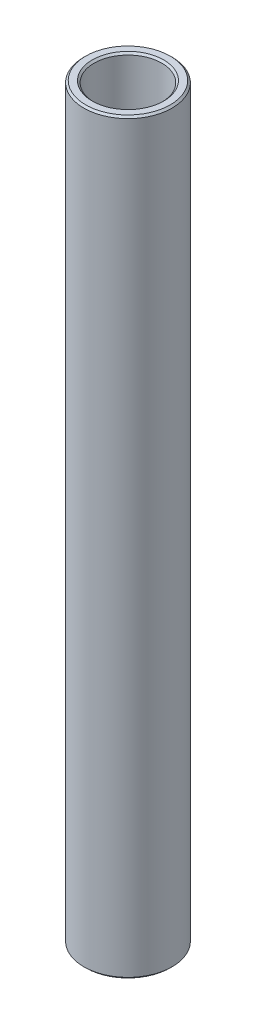
ISO-10303-21;
HEADER;
FILE_DESCRIPTION(('STEP AP214'),'2;1');
FILE_NAME('part.step','',(''),(''),'','','');
FILE_SCHEMA(('AUTOMOTIVE_DESIGN { 1 0 10303 214 1 1 1 1 }'));
ENDSEC;
DATA;
#1=APPLICATION_CONTEXT('core data for automotive mechanical design processes');
#2=APPLICATION_PROTOCOL_DEFINITION('international standard','automotive_design',2000,#1);
#3=PRODUCT_CONTEXT('',#1,'mechanical');
#4=PRODUCT('Part','Part','',(#3));
#5=PRODUCT_RELATED_PRODUCT_CATEGORY('part','',(#4));
#6=PRODUCT_DEFINITION_FORMATION('','',#4);
#7=PRODUCT_DEFINITION_CONTEXT('part definition',#1,'design');
#8=PRODUCT_DEFINITION('design','',#6,#7);
#9=PRODUCT_DEFINITION_SHAPE('','',#8);
#10=(LENGTH_UNIT() NAMED_UNIT(*) SI_UNIT(.MILLI.,.METRE.));
#11=(NAMED_UNIT(*) PLANE_ANGLE_UNIT() SI_UNIT($,.RADIAN.));
#12=(NAMED_UNIT(*) SI_UNIT($,.STERADIAN.) SOLID_ANGLE_UNIT());
#13=UNCERTAINTY_MEASURE_WITH_UNIT(LENGTH_MEASURE(1.E-05),#10,'distance_accuracy_value','');
#14=(GEOMETRIC_REPRESENTATION_CONTEXT(3) GLOBAL_UNCERTAINTY_ASSIGNED_CONTEXT((#13)) GLOBAL_UNIT_ASSIGNED_CONTEXT((#10,
#11,#12)) REPRESENTATION_CONTEXT('',''));
#15=CARTESIAN_POINT('',(0.,0.,0.));
#16=DIRECTION('',(0.,0.,1.));
#17=DIRECTION('',(1.,0.,0.));
#18=AXIS2_PLACEMENT_3D('',#15,#16,#17);
#19=CARTESIAN_POINT('',(3.00000000000001,25.4,0.));
#20=DIRECTION('',(0.,-1.,0.));
#21=DIRECTION('',(0.,0.,-1.));
#22=AXIS2_PLACEMENT_3D('',#19,#20,#21);
#23=PLANE('',#22);
#24=CARTESIAN_POINT('',(0.,25.4,0.));
#25=DIRECTION('',(0.,-1.,0.));
#26=DIRECTION('',(0.,0.,-1.));
#27=AXIS2_PLACEMENT_3D('',#24,#25,#26);
#28=CIRCLE('',#27,2.87300000000001);
#29=CARTESIAN_POINT('',(0.,25.4,-2.87300000000001));
#30=VERTEX_POINT('',#29);
#31=EDGE_CURVE('E10',#30,#30,#28,.F.);
#32=ORIENTED_EDGE('',*,*,#31,.T.);
#33=EDGE_LOOP('',(#32));
#34=FACE_BOUND('',#33,.T.);
#35=CARTESIAN_POINT('',(0.,25.4,0.));
#36=DIRECTION('',(0.,-1.,0.));
#37=DIRECTION('',(0.,0.,-1.));
#38=AXIS2_PLACEMENT_3D('',#35,#36,#37);
#39=CIRCLE('',#38,2.427);
#40=CARTESIAN_POINT('',(0.,25.4,-2.427));
#41=VERTEX_POINT('',#40);
#42=EDGE_CURVE('E37',#41,#41,#39,.T.);
#43=ORIENTED_EDGE('',*,*,#42,.T.);
#44=EDGE_LOOP('',(#43));
#45=FACE_BOUND('',#44,.T.);
#46=ADVANCED_FACE('F30',(#34,#45),#23,.F.);
#47=CARTESIAN_POINT('',(0.,19.0679886685552,0.));
#48=DIRECTION('',(0.,1.,0.));
#49=DIRECTION('',(0.,0.,1.));
#50=AXIS2_PLACEMENT_3D('',#47,#48,#49);
#51=CYLINDRICAL_SURFACE('',#50,2.3);
#52=CARTESIAN_POINT('',(0.,-25.273,0.));
#53=DIRECTION('',(0.,1.,0.));
#54=DIRECTION('',(0.,0.,1.));
#55=AXIS2_PLACEMENT_3D('',#52,#53,#54);
#56=CIRCLE('',#55,2.3);
#57=CARTESIAN_POINT('',(0.,-25.273,2.3));
#58=VERTEX_POINT('',#57);
#59=EDGE_CURVE('E50',#58,#58,#56,.F.);
#60=ORIENTED_EDGE('',*,*,#59,.T.);
#61=EDGE_LOOP('',(#60));
#62=FACE_BOUND('',#61,.T.);
#63=CARTESIAN_POINT('',(0.,25.273,0.));
#64=DIRECTION('',(0.,-1.,0.));
#65=DIRECTION('',(0.,0.,-1.));
#66=AXIS2_PLACEMENT_3D('',#63,#64,#65);
#67=CIRCLE('',#66,2.3);
#68=CARTESIAN_POINT('',(0.,25.273,-2.3));
#69=VERTEX_POINT('',#68);
#70=EDGE_CURVE('E53',#69,#69,#67,.F.);
#71=ORIENTED_EDGE('',*,*,#70,.T.);
#72=EDGE_LOOP('',(#71));
#73=FACE_BOUND('',#72,.T.);
#74=ADVANCED_FACE('F86',(#62,#73),#51,.F.);
#75=CARTESIAN_POINT('',(2.30000000000001,-25.4,0.));
#76=DIRECTION('',(0.,1.,0.));
#77=DIRECTION('',(0.,0.,1.));
#78=AXIS2_PLACEMENT_3D('',#75,#76,#77);
#79=PLANE('',#78);
#80=CARTESIAN_POINT('',(0.,-25.4,0.));
#81=DIRECTION('',(0.,1.,0.));
#82=DIRECTION('',(0.,0.,1.));
#83=AXIS2_PLACEMENT_3D('',#80,#81,#82);
#84=CIRCLE('',#83,2.42700000000001);
#85=CARTESIAN_POINT('',(0.,-25.4,2.42700000000001));
#86=VERTEX_POINT('',#85);
#87=EDGE_CURVE('E56',#86,#86,#84,.T.);
#88=ORIENTED_EDGE('',*,*,#87,.T.);
#89=EDGE_LOOP('',(#88));
#90=FACE_BOUND('',#89,.T.);
#91=CARTESIAN_POINT('',(0.,-25.4,0.));
#92=DIRECTION('',(0.,1.,0.));
#93=DIRECTION('',(0.,0.,1.));
#94=AXIS2_PLACEMENT_3D('',#91,#92,#93);
#95=CIRCLE('',#94,2.87299999999999);
#96=CARTESIAN_POINT('',(0.,-25.4,2.87299999999999));
#97=VERTEX_POINT('',#96);
#98=EDGE_CURVE('E59',#97,#97,#95,.F.);
#99=ORIENTED_EDGE('',*,*,#98,.T.);
#100=EDGE_LOOP('',(#99));
#101=FACE_BOUND('',#100,.T.);
#102=ADVANCED_FACE('F63',(#90,#101),#79,.F.);
#103=CARTESIAN_POINT('',(0.,19.0679886685552,0.));
#104=DIRECTION('',(0.,1.,0.));
#105=DIRECTION('',(0.,0.,1.));
#106=AXIS2_PLACEMENT_3D('',#103,#104,#105);
#107=CYLINDRICAL_SURFACE('',#106,3.);
#108=CARTESIAN_POINT('',(0.,-25.273,0.));
#109=DIRECTION('',(0.,1.,0.));
#110=DIRECTION('',(0.,0.,1.));
#111=AXIS2_PLACEMENT_3D('',#108,#109,#110);
#112=CIRCLE('',#111,3.);
#113=CARTESIAN_POINT('',(0.,-25.273,3.));
#114=VERTEX_POINT('',#113);
#115=EDGE_CURVE('E41',#114,#114,#112,.T.);
#116=ORIENTED_EDGE('',*,*,#115,.T.);
#117=EDGE_LOOP('',(#116));
#118=FACE_BOUND('',#117,.T.);
#119=CARTESIAN_POINT('',(0.,25.273,0.));
#120=DIRECTION('',(0.,-1.,0.));
#121=DIRECTION('',(0.,0.,-1.));
#122=AXIS2_PLACEMENT_3D('',#119,#120,#121);
#123=CIRCLE('',#122,3.);
#124=CARTESIAN_POINT('',(0.,25.273,-3.));
#125=VERTEX_POINT('',#124);
#126=EDGE_CURVE('E45',#125,#125,#123,.T.);
#127=ORIENTED_EDGE('',*,*,#126,.T.);
#128=EDGE_LOOP('',(#127));
#129=FACE_BOUND('',#128,.T.);
#130=ADVANCED_FACE('F73',(#118,#129),#107,.T.);
#131=CARTESIAN_POINT('',(0.,-25.4,0.));
#132=DIRECTION('',(0.,-1.,0.));
#133=DIRECTION('',(0.,0.,-1.));
#134=AXIS2_PLACEMENT_3D('',#131,#132,#133);
#135=CONICAL_SURFACE('',#134,2.42700000000001,0.785398163397457);
#136=ORIENTED_EDGE('',*,*,#59,.F.);
#137=EDGE_LOOP('',(#136));
#138=FACE_BOUND('',#137,.T.);
#139=ORIENTED_EDGE('',*,*,#87,.F.);
#140=EDGE_LOOP('',(#139));
#141=FACE_BOUND('',#140,.T.);
#142=ADVANCED_FACE('F69',(#138,#141),#135,.F.);
#143=CARTESIAN_POINT('',(0.,-25.273,0.));
#144=DIRECTION('',(0.,1.,0.));
#145=DIRECTION('',(0.,0.,1.));
#146=AXIS2_PLACEMENT_3D('',#143,#144,#145);
#147=CONICAL_SURFACE('',#146,3.,0.785398163397467);
#148=ORIENTED_EDGE('',*,*,#98,.F.);
#149=EDGE_LOOP('',(#148));
#150=FACE_BOUND('',#149,.T.);
#151=ORIENTED_EDGE('',*,*,#115,.F.);
#152=EDGE_LOOP('',(#151));
#153=FACE_BOUND('',#152,.T.);
#154=ADVANCED_FACE('F65',(#150,#153),#147,.T.);
#155=CARTESIAN_POINT('',(0.,25.4,0.));
#156=DIRECTION('',(0.,-1.,0.));
#157=DIRECTION('',(0.,0.,-1.));
#158=AXIS2_PLACEMENT_3D('',#155,#156,#157);
#159=CONICAL_SURFACE('',#158,2.87300000000001,0.785398163397453);
#160=ORIENTED_EDGE('',*,*,#126,.F.);
#161=EDGE_LOOP('',(#160));
#162=FACE_BOUND('',#161,.T.);
#163=ORIENTED_EDGE('',*,*,#31,.F.);
#164=EDGE_LOOP('',(#163));
#165=FACE_BOUND('',#164,.T.);
#166=ADVANCED_FACE('F68',(#162,#165),#159,.T.);
#167=CARTESIAN_POINT('',(0.,25.273,0.));
#168=DIRECTION('',(0.,1.,0.));
#169=DIRECTION('',(0.,0.,1.));
#170=AXIS2_PLACEMENT_3D('',#167,#168,#169);
#171=CONICAL_SURFACE('',#170,2.3,0.785398163397457);
#172=ORIENTED_EDGE('',*,*,#42,.F.);
#173=EDGE_LOOP('',(#172));
#174=FACE_BOUND('',#173,.T.);
#175=ORIENTED_EDGE('',*,*,#70,.F.);
#176=EDGE_LOOP('',(#175));
#177=FACE_BOUND('',#176,.T.);
#178=ADVANCED_FACE('F32',(#174,#177),#171,.F.);
#179=CLOSED_SHELL('',(#46,#74,#102,#130,#142,#154,#166,#178));
#180=MANIFOLD_SOLID_BREP('B2',#179);
#181=ADVANCED_BREP_SHAPE_REPRESENTATION('',(#18,#180),#14);
#182=SHAPE_DEFINITION_REPRESENTATION(#9,#181);
ENDSEC;
END-ISO-10303-21;
